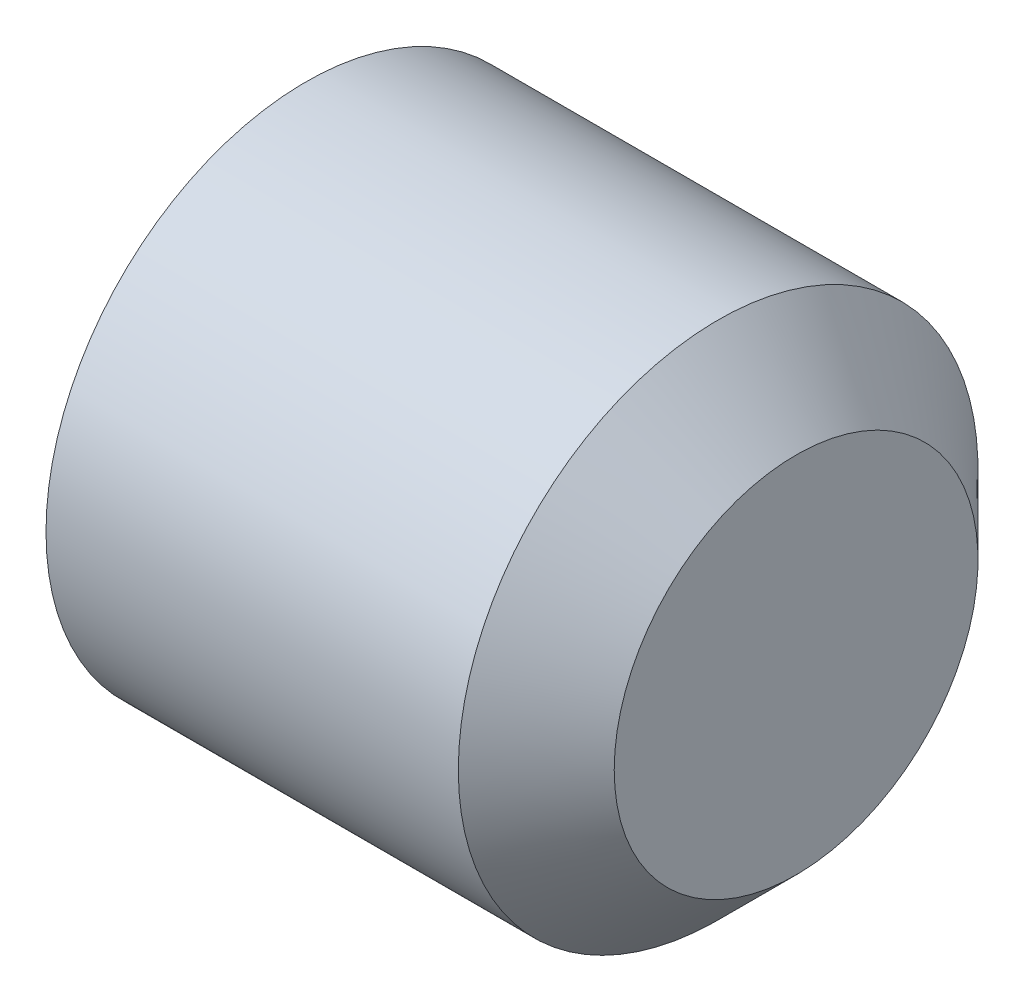
ISO-10303-21;
HEADER;
FILE_DESCRIPTION(('STEP AP214'),'2;1');
FILE_NAME('part.step','',(''),(''),'','','');
FILE_SCHEMA(('AUTOMOTIVE_DESIGN { 1 0 10303 214 1 1 1 1 }'));
ENDSEC;
DATA;
#1=APPLICATION_CONTEXT('core data for automotive mechanical design processes');
#2=APPLICATION_PROTOCOL_DEFINITION('international standard','automotive_design',2000,#1);
#3=PRODUCT_CONTEXT('',#1,'mechanical');
#4=PRODUCT('Part','Part','',(#3));
#5=PRODUCT_RELATED_PRODUCT_CATEGORY('part','',(#4));
#6=PRODUCT_DEFINITION_FORMATION('','',#4);
#7=PRODUCT_DEFINITION_CONTEXT('part definition',#1,'design');
#8=PRODUCT_DEFINITION('design','',#6,#7);
#9=PRODUCT_DEFINITION_SHAPE('','',#8);
#10=(LENGTH_UNIT() NAMED_UNIT(*) SI_UNIT(.MILLI.,.METRE.));
#11=(NAMED_UNIT(*) PLANE_ANGLE_UNIT() SI_UNIT($,.RADIAN.));
#12=(NAMED_UNIT(*) SI_UNIT($,.STERADIAN.) SOLID_ANGLE_UNIT());
#13=UNCERTAINTY_MEASURE_WITH_UNIT(LENGTH_MEASURE(1.E-05),#10,'distance_accuracy_value','');
#14=(GEOMETRIC_REPRESENTATION_CONTEXT(3) GLOBAL_UNCERTAINTY_ASSIGNED_CONTEXT((#13)) GLOBAL_UNIT_ASSIGNED_CONTEXT((#10,
#11,#12)) REPRESENTATION_CONTEXT('',''));
#15=CARTESIAN_POINT('',(0.,0.,0.));
#16=DIRECTION('',(0.,0.,1.));
#17=DIRECTION('',(1.,0.,0.));
#18=AXIS2_PLACEMENT_3D('',#15,#16,#17);
#19=CARTESIAN_POINT('',(0.83333333333333,0.,0.));
#20=DIRECTION('',(-1.,0.,0.));
#21=DIRECTION('',(0.,0.,1.));
#22=AXIS2_PLACEMENT_3D('',#19,#20,#21);
#23=CONICAL_SURFACE('',#22,0.,1.04719755119661);
#24=CARTESIAN_POINT('',(0.,0.,0.));
#25=DIRECTION('',(-1.,0.,0.));
#26=DIRECTION('',(0.,0.,1.));
#27=AXIS2_PLACEMENT_3D('',#24,#25,#26);
#28=CIRCLE('',#27,1.4433756729741);
#29=CARTESIAN_POINT('',(0.,0.,1.4433756729741));
#30=VERTEX_POINT('',#29);
#31=CARTESIAN_POINT('',(0.,1.25000000000003,0.721687836487051));
#32=VERTEX_POINT('',#31);
#33=EDGE_CURVE('E139',#30,#32,#28,.T.);
#34=ORIENTED_EDGE('',*,*,#33,.T.);
#35=CARTESIAN_POINT('',(-6.66746660219313E-05,1.25020000000002,0.721572366433221));
#36=CARTESIAN_POINT('',(0.0182540852363146,1.19526669476825,0.753288124996257));
#37=CARTESIAN_POINT('',(0.0349166937993671,1.13985921349977,0.78527764922173));
#38=CARTESIAN_POINT('',(0.0640026960542333,1.02808463239967,0.849810733708432));
#39=CARTESIAN_POINT('',(0.0764157980239526,0.971715545158301,0.882355441401211));
#40=CARTESIAN_POINT('',(0.0957403123639898,0.859676025913025,0.947041487997347));
#41=CARTESIAN_POINT('',(0.102780310552569,0.804022841540779,0.979172868975923));
#42=CARTESIAN_POINT('',(0.111187567369367,0.692454346091615,1.04358696985658));
#43=CARTESIAN_POINT('',(0.112561784795276,0.636539441062406,1.07586945532691));
#44=CARTESIAN_POINT('',(0.109716662632079,0.532042078818279,1.13620103554816));
#45=CARTESIAN_POINT('',(0.106195901179983,0.483444050118688,1.16425912049995));
#46=CARTESIAN_POINT('',(0.0950328873007429,0.386564637826765,1.22019247526563));
#47=CARTESIAN_POINT('',(0.0873868144273217,0.33828358980784,1.24806755133611));
#48=CARTESIAN_POINT('',(0.0682705452994674,0.241204116145959,1.30411641158758));
#49=CARTESIAN_POINT('',(0.0567192430203415,0.192417989648102,1.33228309485384));
#50=CARTESIAN_POINT('',(0.0305016853061078,0.095573747707899,1.38819614400748));
#51=CARTESIAN_POINT('',(0.0158415978608937,0.0475143896730363,1.41594322730599));
#52=CARTESIAN_POINT('',(-6.66746660267736E-05,-0.000200000000000035,1.44349114302794));
#53=B_SPLINE_CURVE_WITH_KNOTS('',3,(#35,#36,#37,#38,#39,#40,#41,#42,#43,#44,#45,#46,#47,#48,#49,
#50,#51,#52),.UNSPECIFIED.,.F.,.F.,(4,2,2,2,2,2,2,2,4),(0.,0.198150821029562,0.396778196315227,
0.590488617354409,0.783961049317194,0.95248005639866,1.12115539730011,1.29357430343591,
1.46565426976932),.UNSPECIFIED.);
#54=EDGE_CURVE('E11',#32,#30,#53,.T.);
#55=ORIENTED_EDGE('',*,*,#54,.T.);
#56=EDGE_LOOP('',(#34,#55));
#57=FACE_BOUND('',#56,.T.);
#58=ADVANCED_FACE('F40',(#57),#23,.F.);
#59=CARTESIAN_POINT('',(0.,-1.25000000000002,0.721687836487058));
#60=VERTEX_POINT('',#59);
#61=EDGE_CURVE('E138',#60,#30,#28,.T.);
#62=ORIENTED_EDGE('',*,*,#61,.T.);
#63=CARTESIAN_POINT('',(-6.66746660268099E-05,0.000199999999999981,1.44349114302794));
#64=CARTESIAN_POINT('',(0.0182540852363098,-0.0547333052317663,1.4117753844649));
#65=CARTESIAN_POINT('',(0.0349166937993627,-0.110140786500242,1.37978586023943));
#66=CARTESIAN_POINT('',(0.06400269605423,-0.221915367600345,1.31525277575273));
#67=CARTESIAN_POINT('',(0.0764157980239499,-0.278284454841716,1.28270806805995));
#68=CARTESIAN_POINT('',(0.0957403123639879,-0.390323974086993,1.21802202146381));
#69=CARTESIAN_POINT('',(0.102780310552568,-0.445977158459239,1.18589064048523));
#70=CARTESIAN_POINT('',(0.111187567369366,-0.557545653908403,1.12147653960458));
#71=CARTESIAN_POINT('',(0.112561784795275,-0.613460558937613,1.08919405413425));
#72=CARTESIAN_POINT('',(0.10971666263208,-0.717957921181739,1.028862473913));
#73=CARTESIAN_POINT('',(0.106195901179984,-0.76655594988133,1.0008043889612));
#74=CARTESIAN_POINT('',(0.0950328873007448,-0.863435362173253,0.94487103419553));
#75=CARTESIAN_POINT('',(0.087386814427324,-0.911716410192178,0.916995958125047));
#76=CARTESIAN_POINT('',(0.0682705452994706,-1.00879588385406,0.860947097873573));
#77=CARTESIAN_POINT('',(0.0567192430203451,-1.05758201035191,0.832780414607316));
#78=CARTESIAN_POINT('',(0.0305016853061119,-1.15442625229212,0.776867365453675));
#79=CARTESIAN_POINT('',(0.0158415978608981,-1.20248561032698,0.749120282155167));
#80=CARTESIAN_POINT('',(-6.66746660219481E-05,-1.25020000000002,0.721572366433221));
#81=B_SPLINE_CURVE_WITH_KNOTS('',3,(#63,#64,#65,#66,#67,#68,#69,#70,#71,#72,#73,#74,#75,#76,#77,
#78,#79,#80),.UNSPECIFIED.,.F.,.F.,(4,2,2,2,2,2,2,2,4),(0.,0.198150821029564,0.396778196315229,
0.590488617354412,0.783961049317198,0.952480056398663,1.12115539730011,1.29357430343592,
1.46565426976932),.UNSPECIFIED.);
#82=EDGE_CURVE('E54',#30,#60,#81,.T.);
#83=ORIENTED_EDGE('',*,*,#82,.T.);
#84=EDGE_LOOP('',(#62,#83));
#85=FACE_BOUND('',#84,.T.);
#86=ADVANCED_FACE('F214',(#85),#23,.F.);
#87=CARTESIAN_POINT('',(0.,-1.25000000000002,-0.721687836487002));
#88=VERTEX_POINT('',#87);
#89=EDGE_CURVE('E242',#88,#60,#28,.T.);
#90=ORIENTED_EDGE('',*,*,#89,.T.);
#91=CARTESIAN_POINT('',(-0.723125533725218,-1.25000000000002,2.38855450315372));
#92=CARTESIAN_POINT('',(-0.694512714136866,-1.25000000000002,2.33261400232343));
#93=CARTESIAN_POINT('',(-0.66606638488083,-1.25000000000002,2.27658784489106));
#94=CARTESIAN_POINT('',(-0.609585913438912,-1.25000000000002,2.16432677662066));
#95=CARTESIAN_POINT('',(-0.581551780027691,-1.25000000000002,2.10809186137049));
#96=CARTESIAN_POINT('',(-0.498093498263183,-1.25000000000002,1.93882910957217));
#97=CARTESIAN_POINT('',(-0.443411639249018,-1.25000000000002,1.82543388021049));
#98=CARTESIAN_POINT('',(-0.334298848658163,-1.25000000000002,1.59142958961822));
#99=CARTESIAN_POINT('',(-0.280022481335802,-1.25000000000002,1.47074722047899));
#100=CARTESIAN_POINT('',(-0.202661005486305,-1.25000000000002,1.28803679596571));
#101=CARTESIAN_POINT('',(-0.177555163940496,-1.25000000000002,1.22686777081667));
#102=CARTESIAN_POINT('',(-0.129115153823104,-1.25000000000002,1.10383524784599));
#103=CARTESIAN_POINT('',(-0.105780807369272,-1.25000000000002,1.04197182046975));
#104=CARTESIAN_POINT('',(-0.0574567956154591,-1.25000000000002,0.906290686389106));
#105=CARTESIAN_POINT('',(-0.0329155229053761,-1.25000000000002,0.832310829015467));
#106=CARTESIAN_POINT('',(0.0117528005591605,-1.25000000000002,0.683045282747963));
#107=CARTESIAN_POINT('',(0.0318821801489908,-1.25000000000002,0.607760305524386));
#108=CARTESIAN_POINT('',(0.0658999098953772,-1.25000000000002,0.457227311030485));
#109=CARTESIAN_POINT('',(0.0798975032663708,-1.25000000000002,0.382004714348821));
#110=CARTESIAN_POINT('',(0.100694509672485,-1.25000000000002,0.230574793536791));
#111=CARTESIAN_POINT('',(0.107497972399627,-1.25000000000002,0.154368047882492));
#112=CARTESIAN_POINT('',(0.113017067627266,-1.25000000000002,0.000758127504506175));
#113=CARTESIAN_POINT('',(0.111637545538924,-1.25000000000002,-0.0766486420869878));
#114=CARTESIAN_POINT('',(0.100772950050972,-1.25000000000002,-0.230894929107457));
#115=CARTESIAN_POINT('',(0.0912846749924727,-1.25000000000002,-0.307734210380375));
#116=CARTESIAN_POINT('',(0.0651909747562643,-1.25000000000002,-0.461702943031744));
#117=CARTESIAN_POINT('',(0.0484494878936388,-1.25000000000002,-0.538808478119655));
#118=CARTESIAN_POINT('',(0.00949941464194663,-1.25000000000002,-0.691605492713038));
#119=CARTESIAN_POINT('',(-0.0127104303057358,-1.25000000000002,-0.767296642372799));
#120=CARTESIAN_POINT('',(-0.0591758290557663,-1.25000000000002,-0.91131122625957));
#121=CARTESIAN_POINT('',(-0.0831218497054745,-1.25000000000002,-0.979736466805027));
#122=CARTESIAN_POINT('',(-0.133531682963292,-1.25000000000002,-1.11565965802141));
#123=CARTESIAN_POINT('',(-0.159995993229588,-1.25000000000002,-1.18315742237818));
#124=CARTESIAN_POINT('',(-0.214822951192086,-1.25000000000002,-1.31744060643002));
#125=CARTESIAN_POINT('',(-0.243187240234055,-1.25000000000002,-1.38422535089341));
#126=CARTESIAN_POINT('',(-0.301338794191647,-1.25000000000002,-1.51717422229082));
#127=CARTESIAN_POINT('',(-0.331126152263779,-1.25000000000002,-1.58333830825537));
#128=CARTESIAN_POINT('',(-0.418871668434598,-1.25000000000002,-1.77405787301153));
#129=CARTESIAN_POINT('',(-0.478222830298611,-1.25000000000002,-1.89797140255541));
#130=CARTESIAN_POINT('',(-0.568973030237184,-1.25000000000002,-2.08276459736176));
#131=CARTESIAN_POINT('',(-0.59946560514473,-1.25000000000002,-2.14409605852878));
#132=CARTESIAN_POINT('',(-0.660947546416482,-1.25000000000002,-2.26650353643493));
#133=CARTESIAN_POINT('',(-0.691936873120399,-1.25000000000002,-2.32757957308086));
#134=CARTESIAN_POINT('',(-0.723125533725189,-1.25000000000002,-2.38855450315366));
#135=B_SPLINE_CURVE_WITH_KNOTS('',3,(#91,#92,#93,#94,#95,#96,#97,#98,#99,#100,#101,#102,#103,
#104,#105,#106,#107,#108,#109,#110,#111,#112,#113,#114,#115,#116,#117,#118,#119,#120,#121,#122,
#123,#124,#125,#126,#127,#128,#129,#130,#131,#132,#133,#134),.UNSPECIFIED.,.F.,.F.,(4,2,2,2,2,2,
2,2,2,2,2,2,2,2,2,2,2,2,2,2,2,4),(0.,0.188500396101583,0.377004799132287,0.754656745053071,
1.15153907639069,1.3498805083985,1.54820199780876,1.78193522701242,2.0155447804655,
2.24480392033555,2.47393393772945,2.70573354165869,2.93762471161865,3.17406818753763,
3.41056613256657,3.62798696703794,3.84545085726258,4.06310509441107,4.28077359915012,
4.69290371598787,4.8983831803543,5.10384632030758),.UNSPECIFIED.);
#136=EDGE_CURVE('E188',#60,#88,#135,.T.);
#137=ORIENTED_EDGE('',*,*,#136,.T.);
#138=EDGE_LOOP('',(#90,#137));
#139=FACE_BOUND('',#138,.T.);
#140=ADVANCED_FACE('F220',(#139),#23,.F.);
#141=CARTESIAN_POINT('',(0.,0.,-1.44337567297404));
#142=VERTEX_POINT('',#141);
#143=EDGE_CURVE('E240',#142,#88,#28,.T.);
#144=ORIENTED_EDGE('',*,*,#143,.T.);
#145=CARTESIAN_POINT('',(-6.66746660057022E-05,-1.25020000000002,-0.721572366433164));
#146=CARTESIAN_POINT('',(0.0182540852363312,-1.19526669476825,-0.753288124996199));
#147=CARTESIAN_POINT('',(0.0349166937993845,-1.13985921349978,-0.785277649221672));
#148=CARTESIAN_POINT('',(0.0640026960542528,-1.02808463239968,-0.849810733708372));
#149=CARTESIAN_POINT('',(0.0764157980239733,-0.971715545158308,-0.882355441401151));
#150=CARTESIAN_POINT('',(0.0957403123640127,-0.859676025913034,-0.947041487997285));
#151=CARTESIAN_POINT('',(0.102780310552593,-0.80402284154079,-0.979172868975861));
#152=CARTESIAN_POINT('',(0.111187567369394,-0.692454346091628,-1.04358696985652));
#153=CARTESIAN_POINT('',(0.112561784795304,-0.63653944106242,-1.07586945532684));
#154=CARTESIAN_POINT('',(0.10971666263211,-0.532042078818294,-1.13620103554809));
#155=CARTESIAN_POINT('',(0.106195901180015,-0.483444050118702,-1.16425912049989));
#156=CARTESIAN_POINT('',(0.0950328873007757,-0.386564637826775,-1.22019247526556));
#157=CARTESIAN_POINT('',(0.087386814427355,-0.338283589807849,-1.24806755133605));
#158=CARTESIAN_POINT('',(0.0682705452995012,-0.241204116145966,-1.30411641158752));
#159=CARTESIAN_POINT('',(0.0567192430203753,-0.192417989648107,-1.33228309485378));
#160=CARTESIAN_POINT('',(0.0305016853061413,-0.0955737477079013,-1.38819614400743));
#161=CARTESIAN_POINT('',(0.0158415978609268,-0.0475143896730374,-1.41594322730593));
#162=CARTESIAN_POINT('',(-6.66746659940686E-05,0.000200000000000096,-1.44349114302788));
#163=B_SPLINE_CURVE_WITH_KNOTS('',3,(#145,#146,#147,#148,#149,#150,#151,#152,#153,#154,#155,
#156,#157,#158,#159,#160,#161,#162),.UNSPECIFIED.,.F.,.F.,(4,2,2,2,2,2,2,2,4),(0.,
0.198150821029559,0.396778196315219,0.590488617354397,0.783961049317178,0.952480056398648,
1.1211553973001,1.29357430343591,1.46565426976932),.UNSPECIFIED.);
#164=EDGE_CURVE('E182',#88,#142,#163,.T.);
#165=ORIENTED_EDGE('',*,*,#164,.T.);
#166=EDGE_LOOP('',(#144,#165));
#167=FACE_BOUND('',#166,.T.);
#168=ADVANCED_FACE('F231',(#167),#23,.F.);
#169=CARTESIAN_POINT('',(0.,1.25000000000002,-0.721687836487002));
#170=VERTEX_POINT('',#169);
#171=EDGE_CURVE('E238',#170,#142,#28,.T.);
#172=ORIENTED_EDGE('',*,*,#171,.T.);
#173=CARTESIAN_POINT('',(-6.66746659941212E-05,-0.000199999999999926,-1.44349114302788));
#174=CARTESIAN_POINT('',(0.0182540852363418,0.0547333052317643,-1.41177538446485));
#175=CARTESIAN_POINT('',(0.034916693799394,0.110140786500238,-1.37978586023937));
#176=CARTESIAN_POINT('',(0.0640026960542601,0.221915367600336,-1.31525277575267));
#177=CARTESIAN_POINT('',(0.0764157980239795,0.278284454841706,-1.2827080680599));
#178=CARTESIAN_POINT('',(0.0957403123640169,0.390323974086978,-1.21802202146376));
#179=CARTESIAN_POINT('',(0.102780310552596,0.445977158459222,-1.18589064048519));
#180=CARTESIAN_POINT('',(0.111187567369395,0.557545653908382,-1.12147653960453));
#181=CARTESIAN_POINT('',(0.112561784795304,0.613460558937589,-1.08919405413421));
#182=CARTESIAN_POINT('',(0.109716662632108,0.717957921181716,-1.02886247391296));
#183=CARTESIAN_POINT('',(0.106195901180012,0.766555949881308,-1.00080438896116));
#184=CARTESIAN_POINT('',(0.0950328873007713,0.863435362173236,-0.944871034195484));
#185=CARTESIAN_POINT('',(0.0873868144273497,0.911716410192163,-0.916995958124999));
#186=CARTESIAN_POINT('',(0.0682705452994941,1.00879588385405,-0.860947097873523));
#187=CARTESIAN_POINT('',(0.0567192430203673,1.05758201035191,-0.832780414607265));
#188=CARTESIAN_POINT('',(0.0305016853061314,1.15442625229211,-0.776867365453621));
#189=CARTESIAN_POINT('',(0.015841597860916,1.20248561032698,-0.749120282155111));
#190=CARTESIAN_POINT('',(-6.66746660057401E-05,1.25020000000002,-0.721572366433164));
#191=B_SPLINE_CURVE_WITH_KNOTS('',3,(#173,#174,#175,#176,#177,#178,#179,#180,#181,#182,#183,
#184,#185,#186,#187,#188,#189,#190),.UNSPECIFIED.,.F.,.F.,(4,2,2,2,2,2,2,2,4),(0.,
0.198150821029556,0.396778196315213,0.590488617354389,0.783961049317167,0.952480056398639,
1.1211553973001,1.29357430343591,1.46565426976932),.UNSPECIFIED.);
#192=EDGE_CURVE('E121',#142,#170,#191,.T.);
#193=ORIENTED_EDGE('',*,*,#192,.T.);
#194=EDGE_LOOP('',(#172,#193));
#195=FACE_BOUND('',#194,.T.);
#196=ADVANCED_FACE('F223',(#195),#23,.F.);
#197=EDGE_CURVE('E143',#32,#170,#28,.T.);
#198=ORIENTED_EDGE('',*,*,#197,.T.);
#199=CARTESIAN_POINT('',(-0.72312553372519,1.25000000000002,-2.38855450315366));
#200=CARTESIAN_POINT('',(-0.694512714136838,1.25000000000002,-2.33261400232338));
#201=CARTESIAN_POINT('',(-0.666066384880803,1.25000000000002,-2.27658784489101));
#202=CARTESIAN_POINT('',(-0.609585913438887,1.25000000000002,-2.16432677662061));
#203=CARTESIAN_POINT('',(-0.581551780027666,1.25000000000002,-2.10809186137044));
#204=CARTESIAN_POINT('',(-0.49809349826316,1.25000000000002,-1.93882910957213));
#205=CARTESIAN_POINT('',(-0.443411639248997,1.25000000000002,-1.82543388021045));
#206=CARTESIAN_POINT('',(-0.334298848658144,1.25000000000002,-1.59142958961817));
#207=CARTESIAN_POINT('',(-0.280022481335785,1.25000000000002,-1.47074722047895));
#208=CARTESIAN_POINT('',(-0.20266100548629,1.25000000000002,-1.28803679596567));
#209=CARTESIAN_POINT('',(-0.177555163940482,1.25000000000002,-1.22686777081664));
#210=CARTESIAN_POINT('',(-0.129115153823092,1.25000000000002,-1.10383524784596));
#211=CARTESIAN_POINT('',(-0.105780807369261,1.25000000000002,-1.04197182046972));
#212=CARTESIAN_POINT('',(-0.0574567956154493,1.25000000000002,-0.906290686389077));
#213=CARTESIAN_POINT('',(-0.0329155229053671,1.25000000000002,-0.832310829015439));
#214=CARTESIAN_POINT('',(0.0117528005591679,1.25000000000002,-0.683045282747935));
#215=CARTESIAN_POINT('',(0.0318821801489975,1.25000000000002,-0.607760305524359));
#216=CARTESIAN_POINT('',(0.0658999098953822,1.25000000000002,-0.45722731103046));
#217=CARTESIAN_POINT('',(0.0798975032663748,1.25000000000002,-0.382004714348796));
#218=CARTESIAN_POINT('',(0.100694509672488,1.25000000000002,-0.230574793536767));
#219=CARTESIAN_POINT('',(0.107497972399629,1.25000000000002,-0.154368047882468));
#220=CARTESIAN_POINT('',(0.113017067627266,1.25000000000002,-0.000758127504484545));
#221=CARTESIAN_POINT('',(0.111637545538924,1.25000000000002,0.0766486420870085));
#222=CARTESIAN_POINT('',(0.10077295005097,1.25000000000002,0.230894929107476));
#223=CARTESIAN_POINT('',(0.0912846749924701,1.25000000000002,0.307734210380393));
#224=CARTESIAN_POINT('',(0.0651909747562611,1.25000000000002,0.46170294303176));
#225=CARTESIAN_POINT('',(0.0484494878936356,1.25000000000002,0.53880847811967));
#226=CARTESIAN_POINT('',(0.0094994146419431,1.25000000000002,0.691605492713051));
#227=CARTESIAN_POINT('',(-0.0127104303057395,1.25000000000002,0.767296642372811));
#228=CARTESIAN_POINT('',(-0.0591758290557709,1.25000000000002,0.911311226259583));
#229=CARTESIAN_POINT('',(-0.08312184970548,1.25000000000002,0.979736466805042));
#230=CARTESIAN_POINT('',(-0.1335316829633,1.25000000000002,1.11565965802143));
#231=CARTESIAN_POINT('',(-0.159995993229597,1.25000000000002,1.1831574223782));
#232=CARTESIAN_POINT('',(-0.214822951192096,1.25000000000002,1.31744060643004));
#233=CARTESIAN_POINT('',(-0.243187240234067,1.25000000000002,1.38422535089344));
#234=CARTESIAN_POINT('',(-0.301338794191661,1.25000000000002,1.51717422229085));
#235=CARTESIAN_POINT('',(-0.331126152263794,1.25000000000002,1.5833383082554));
#236=CARTESIAN_POINT('',(-0.418871668434616,1.25000000000002,1.77405787301157));
#237=CARTESIAN_POINT('',(-0.478222830298631,1.25000000000002,1.89797140255546));
#238=CARTESIAN_POINT('',(-0.568973030237207,1.25000000000002,2.0827645973618));
#239=CARTESIAN_POINT('',(-0.599465605144755,1.25000000000002,2.14409605852883));
#240=CARTESIAN_POINT('',(-0.660947546416509,1.25000000000002,2.26650353643498));
#241=CARTESIAN_POINT('',(-0.691936873120427,1.25000000000002,2.32757957308092));
#242=CARTESIAN_POINT('',(-0.723125533725218,1.25000000000002,2.38855450315372));
#243=B_SPLINE_CURVE_WITH_KNOTS('',3,(#199,#200,#201,#202,#203,#204,#205,#206,#207,#208,#209,
#210,#211,#212,#213,#214,#215,#216,#217,#218,#219,#220,#221,#222,#223,#224,#225,#226,#227,#228,
#229,#230,#231,#232,#233,#234,#235,#236,#237,#238,#239,#240,#241,#242),.UNSPECIFIED.,.F.,.F.,(4,
2,2,2,2,2,2,2,2,2,2,2,2,2,2,2,2,2,2,2,2,4),(0.,0.188500396101579,0.377004799132279,
0.754656745053056,1.15153907639067,1.34988050839847,1.54820199780873,1.78193522701238,
2.01554478046546,2.24480392033551,2.47393393772941,2.70573354165865,2.93762471161861,
3.17406818753758,3.41056613256652,3.62798696703789,3.84545085726254,4.06310509441104,
4.28077359915009,4.69290371598786,4.89838318035429,5.10384632030758),.UNSPECIFIED.);
#244=EDGE_CURVE('E87',#170,#32,#243,.T.);
#245=ORIENTED_EDGE('',*,*,#244,.T.);
#246=EDGE_LOOP('',(#198,#245));
#247=FACE_BOUND('',#246,.T.);
#248=ADVANCED_FACE('F216',(#247),#23,.F.);
#249=CARTESIAN_POINT('',(5.,0.,0.));
#250=DIRECTION('',(1.,0.,0.));
#251=DIRECTION('',(0.,0.,-1.));
#252=AXIS2_PLACEMENT_3D('',#249,#250,#251);
#253=PLANE('',#252);
#254=CARTESIAN_POINT('',(5.,0.,0.));
#255=DIRECTION('',(-1.,0.,0.));
#256=DIRECTION('',(0.,0.,1.));
#257=AXIS2_PLACEMENT_3D('',#254,#255,#256);
#258=CIRCLE('',#257,1.75);
#259=CARTESIAN_POINT('',(5.,0.,1.75));
#260=VERTEX_POINT('',#259);
#261=EDGE_CURVE('E152',#260,#260,#258,.T.);
#262=ORIENTED_EDGE('',*,*,#261,.F.);
#263=EDGE_LOOP('',(#262));
#264=FACE_BOUND('',#263,.T.);
#265=ADVANCED_FACE('F42',(#264),#253,.T.);
#266=CARTESIAN_POINT('',(4.25,0.,0.));
#267=DIRECTION('',(-1.,0.,0.));
#268=DIRECTION('',(0.,0.,1.));
#269=AXIS2_PLACEMENT_3D('',#266,#267,#268);
#270=CONICAL_SURFACE('',#269,2.5,0.785398163397449);
#271=ORIENTED_EDGE('',*,*,#261,.T.);
#272=EDGE_LOOP('',(#271));
#273=FACE_BOUND('',#272,.T.);
#274=CARTESIAN_POINT('',(4.25,0.,0.));
#275=DIRECTION('',(-1.,0.,0.));
#276=DIRECTION('',(0.,0.,1.));
#277=AXIS2_PLACEMENT_3D('',#274,#275,#276);
#278=CIRCLE('',#277,2.5);
#279=CARTESIAN_POINT('',(4.25,0.,2.5));
#280=VERTEX_POINT('',#279);
#281=EDGE_CURVE('E149',#280,#280,#278,.T.);
#282=ORIENTED_EDGE('',*,*,#281,.F.);
#283=EDGE_LOOP('',(#282));
#284=FACE_BOUND('',#283,.T.);
#285=ADVANCED_FACE('F229',(#273,#284),#270,.T.);
#286=CARTESIAN_POINT('',(0.83333333333333,0.,0.));
#287=DIRECTION('',(-1.,0.,0.));
#288=DIRECTION('',(0.,0.,1.));
#289=AXIS2_PLACEMENT_3D('',#286,#287,#288);
#290=CYLINDRICAL_SURFACE('',#289,2.5);
#291=ORIENTED_EDGE('',*,*,#281,.T.);
#292=EDGE_LOOP('',(#291));
#293=FACE_BOUND('',#292,.T.);
#294=CARTESIAN_POINT('',(0.28319030703751,0.,0.));
#295=DIRECTION('',(-1.,0.,0.));
#296=DIRECTION('',(0.,0.,1.));
#297=AXIS2_PLACEMENT_3D('',#294,#295,#296);
#298=CIRCLE('',#297,2.5);
#299=CARTESIAN_POINT('',(0.28319030703751,0.,2.5));
#300=VERTEX_POINT('',#299);
#301=EDGE_CURVE('E146',#300,#300,#298,.T.);
#302=ORIENTED_EDGE('',*,*,#301,.F.);
#303=EDGE_LOOP('',(#302));
#304=FACE_BOUND('',#303,.T.);
#305=ADVANCED_FACE('F280',(#293,#304),#290,.T.);
#306=CARTESIAN_POINT('',(0.,0.,0.));
#307=DIRECTION('',(1.,0.,0.));
#308=DIRECTION('',(0.,0.,-1.));
#309=AXIS2_PLACEMENT_3D('',#306,#307,#308);
#310=CONICAL_SURFACE('',#309,2.0095,1.0471975511966);
#311=ORIENTED_EDGE('',*,*,#301,.T.);
#312=EDGE_LOOP('',(#311));
#313=FACE_BOUND('',#312,.T.);
#314=CARTESIAN_POINT('',(0.,0.,0.));
#315=DIRECTION('',(-1.,0.,0.));
#316=DIRECTION('',(0.,0.,1.));
#317=AXIS2_PLACEMENT_3D('',#314,#315,#316);
#318=CIRCLE('',#317,2.0095);
#319=CARTESIAN_POINT('',(0.,0.,2.0095));
#320=VERTEX_POINT('',#319);
#321=EDGE_CURVE('E142',#320,#320,#318,.T.);
#322=ORIENTED_EDGE('',*,*,#321,.F.);
#323=EDGE_LOOP('',(#322));
#324=FACE_BOUND('',#323,.T.);
#325=ADVANCED_FACE('F211',(#313,#324),#310,.T.);
#326=CARTESIAN_POINT('',(0.,-2.0095,0.));
#327=DIRECTION('',(-1.,0.,0.));
#328=DIRECTION('',(0.,0.,1.));
#329=AXIS2_PLACEMENT_3D('',#326,#327,#328);
#330=PLANE('',#329);
#331=ORIENTED_EDGE('',*,*,#321,.T.);
#332=EDGE_LOOP('',(#331));
#333=FACE_BOUND('',#332,.T.);
#334=ORIENTED_EDGE('',*,*,#33,.F.);
#335=ORIENTED_EDGE('',*,*,#61,.F.);
#336=ORIENTED_EDGE('',*,*,#89,.F.);
#337=ORIENTED_EDGE('',*,*,#143,.F.);
#338=ORIENTED_EDGE('',*,*,#171,.F.);
#339=ORIENTED_EDGE('',*,*,#197,.F.);
#340=EDGE_LOOP('',(#334,#335,#336,#337,#338,#339));
#341=FACE_BOUND('',#340,.T.);
#342=ADVANCED_FACE('F206',(#333,#341),#330,.T.);
#343=CARTESIAN_POINT('',(2.,1.25000000000002,0.721687836487058));
#344=DIRECTION('',(0.,-0.5,-0.866025403784439));
#345=DIRECTION('',(0.,0.866025403784439,-0.5));
#346=AXIS2_PLACEMENT_3D('',#343,#344,#345);
#347=PLANE('',#346);
#348=DIRECTION('',(-1.,0.,0.));
#349=VECTOR('',#348,1.);
#350=CARTESIAN_POINT('',(2.,1.25000000000002,0.721687836487058));
#351=LINE('',#350,#349);
#352=CARTESIAN_POINT('',(2.,1.25000000000002,0.721687836487058));
#353=VERTEX_POINT('',#352);
#354=EDGE_CURVE('E61',#353,#32,#351,.T.);
#355=ORIENTED_EDGE('',*,*,#354,.F.);
#356=DIRECTION('',(0.,-0.866025403784439,0.5));
#357=VECTOR('',#356,1.);
#358=CARTESIAN_POINT('',(2.,1.25000000000002,0.721687836487058));
#359=LINE('',#358,#357);
#360=CARTESIAN_POINT('',(2.,0.,1.4433756729741));
#361=VERTEX_POINT('',#360);
#362=EDGE_CURVE('E251',#353,#361,#359,.T.);
#363=ORIENTED_EDGE('',*,*,#362,.T.);
#364=DIRECTION('',(-1.,0.,0.));
#365=VECTOR('',#364,1.);
#366=CARTESIAN_POINT('',(2.,0.,1.4433756729741));
#367=LINE('',#366,#365);
#368=EDGE_CURVE('E135',#361,#30,#367,.T.);
#369=ORIENTED_EDGE('',*,*,#368,.T.);
#370=ORIENTED_EDGE('',*,*,#54,.F.);
#371=EDGE_LOOP('',(#355,#363,#369,#370));
#372=FACE_BOUND('',#371,.T.);
#373=ADVANCED_FACE('F202',(#372),#347,.T.);
#374=CARTESIAN_POINT('',(2.,0.,1.4433756729741));
#375=DIRECTION('',(0.,0.5,-0.866025403784439));
#376=DIRECTION('',(0.,0.866025403784439,0.5));
#377=AXIS2_PLACEMENT_3D('',#374,#375,#376);
#378=PLANE('',#377);
#379=ORIENTED_EDGE('',*,*,#368,.F.);
#380=DIRECTION('',(0.,-0.866025403784439,-0.5));
#381=VECTOR('',#380,1.);
#382=CARTESIAN_POINT('',(2.,0.,1.4433756729741));
#383=LINE('',#382,#381);
#384=CARTESIAN_POINT('',(2.,-1.25000000000002,0.721687836487058));
#385=VERTEX_POINT('',#384);
#386=EDGE_CURVE('E96',#361,#385,#383,.T.);
#387=ORIENTED_EDGE('',*,*,#386,.T.);
#388=DIRECTION('',(-1.,0.,0.));
#389=VECTOR('',#388,1.);
#390=CARTESIAN_POINT('',(2.,-1.25000000000002,0.721687836487058));
#391=LINE('',#390,#389);
#392=EDGE_CURVE('E132',#385,#60,#391,.T.);
#393=ORIENTED_EDGE('',*,*,#392,.T.);
#394=ORIENTED_EDGE('',*,*,#82,.F.);
#395=EDGE_LOOP('',(#379,#387,#393,#394));
#396=FACE_BOUND('',#395,.T.);
#397=ADVANCED_FACE('F199',(#396),#378,.T.);
#398=CARTESIAN_POINT('',(2.,-1.25000000000002,0.721687836487058));
#399=DIRECTION('',(0.,1.,0.));
#400=DIRECTION('',(0.,0.,1.));
#401=AXIS2_PLACEMENT_3D('',#398,#399,#400);
#402=PLANE('',#401);
#403=ORIENTED_EDGE('',*,*,#392,.F.);
#404=DIRECTION('',(0.,0.,-1.));
#405=VECTOR('',#404,1.);
#406=CARTESIAN_POINT('',(2.,-1.25000000000002,0.721687836487058));
#407=LINE('',#406,#405);
#408=CARTESIAN_POINT('',(2.,-1.25000000000002,-0.721687836487002));
#409=VERTEX_POINT('',#408);
#410=EDGE_CURVE('E116',#385,#409,#407,.T.);
#411=ORIENTED_EDGE('',*,*,#410,.T.);
#412=DIRECTION('',(-1.,0.,0.));
#413=VECTOR('',#412,1.);
#414=CARTESIAN_POINT('',(2.,-1.25000000000002,-0.721687836487002));
#415=LINE('',#414,#413);
#416=EDGE_CURVE('E113',#409,#88,#415,.T.);
#417=ORIENTED_EDGE('',*,*,#416,.T.);
#418=ORIENTED_EDGE('',*,*,#136,.F.);
#419=EDGE_LOOP('',(#403,#411,#417,#418));
#420=FACE_BOUND('',#419,.T.);
#421=ADVANCED_FACE('F179',(#420),#402,.T.);
#422=CARTESIAN_POINT('',(2.,-1.25000000000002,-0.721687836487002));
#423=DIRECTION('',(0.,0.5,0.866025403784439));
#424=DIRECTION('',(0.,-0.866025403784439,0.5));
#425=AXIS2_PLACEMENT_3D('',#422,#423,#424);
#426=PLANE('',#425);
#427=ORIENTED_EDGE('',*,*,#416,.F.);
#428=DIRECTION('',(0.,0.866025403784439,-0.5));
#429=VECTOR('',#428,1.);
#430=CARTESIAN_POINT('',(2.,-1.25000000000002,-0.721687836487002));
#431=LINE('',#430,#429);
#432=CARTESIAN_POINT('',(2.,0.,-1.44337567297404));
#433=VERTEX_POINT('',#432);
#434=EDGE_CURVE('E107',#409,#433,#431,.T.);
#435=ORIENTED_EDGE('',*,*,#434,.T.);
#436=DIRECTION('',(-1.,0.,0.));
#437=VECTOR('',#436,1.);
#438=CARTESIAN_POINT('',(2.,0.,-1.44337567297404));
#439=LINE('',#438,#437);
#440=EDGE_CURVE('E110',#433,#142,#439,.T.);
#441=ORIENTED_EDGE('',*,*,#440,.T.);
#442=ORIENTED_EDGE('',*,*,#164,.F.);
#443=EDGE_LOOP('',(#427,#435,#441,#442));
#444=FACE_BOUND('',#443,.T.);
#445=ADVANCED_FACE('F109',(#444),#426,.T.);
#446=CARTESIAN_POINT('',(2.,0.,-1.44337567297404));
#447=DIRECTION('',(0.,-0.5,0.866025403784439));
#448=DIRECTION('',(0.,-0.866025403784439,-0.5));
#449=AXIS2_PLACEMENT_3D('',#446,#447,#448);
#450=PLANE('',#449);
#451=ORIENTED_EDGE('',*,*,#440,.F.);
#452=DIRECTION('',(0.,0.866025403784439,0.5));
#453=VECTOR('',#452,1.);
#454=CARTESIAN_POINT('',(2.,0.,-1.44337567297404));
#455=LINE('',#454,#453);
#456=CARTESIAN_POINT('',(2.,1.25000000000002,-0.721687836487002));
#457=VERTEX_POINT('',#456);
#458=EDGE_CURVE('E115',#433,#457,#455,.T.);
#459=ORIENTED_EDGE('',*,*,#458,.T.);
#460=DIRECTION('',(-1.,0.,0.));
#461=VECTOR('',#460,1.);
#462=CARTESIAN_POINT('',(2.,1.25000000000002,-0.721687836487002));
#463=LINE('',#462,#461);
#464=EDGE_CURVE('E122',#457,#170,#463,.T.);
#465=ORIENTED_EDGE('',*,*,#464,.T.);
#466=ORIENTED_EDGE('',*,*,#192,.F.);
#467=EDGE_LOOP('',(#451,#459,#465,#466));
#468=FACE_BOUND('',#467,.T.);
#469=ADVANCED_FACE('F119',(#468),#450,.T.);
#470=CARTESIAN_POINT('',(2.,1.25000000000002,-0.721687836487002));
#471=DIRECTION('',(0.,-1.,0.));
#472=DIRECTION('',(0.,0.,-1.));
#473=AXIS2_PLACEMENT_3D('',#470,#471,#472);
#474=PLANE('',#473);
#475=ORIENTED_EDGE('',*,*,#464,.F.);
#476=DIRECTION('',(0.,0.,1.));
#477=VECTOR('',#476,1.);
#478=CARTESIAN_POINT('',(2.,1.25000000000002,-0.721687836487002));
#479=LINE('',#478,#477);
#480=EDGE_CURVE('E67',#457,#353,#479,.T.);
#481=ORIENTED_EDGE('',*,*,#480,.T.);
#482=ORIENTED_EDGE('',*,*,#354,.T.);
#483=ORIENTED_EDGE('',*,*,#244,.F.);
#484=EDGE_LOOP('',(#475,#481,#482,#483));
#485=FACE_BOUND('',#484,.T.);
#486=ADVANCED_FACE('F169',(#485),#474,.T.);
#487=CARTESIAN_POINT('',(2.,0.,0.));
#488=DIRECTION('',(1.,0.,0.));
#489=DIRECTION('',(0.,0.,-1.));
#490=AXIS2_PLACEMENT_3D('',#487,#488,#489);
#491=PLANE('',#490);
#492=ORIENTED_EDGE('',*,*,#362,.F.);
#493=ORIENTED_EDGE('',*,*,#480,.F.);
#494=ORIENTED_EDGE('',*,*,#458,.F.);
#495=ORIENTED_EDGE('',*,*,#434,.F.);
#496=ORIENTED_EDGE('',*,*,#410,.F.);
#497=ORIENTED_EDGE('',*,*,#386,.F.);
#498=EDGE_LOOP('',(#492,#493,#494,#495,#496,#497));
#499=FACE_BOUND('',#498,.T.);
#500=ADVANCED_FACE('F124',(#499),#491,.F.);
#501=CLOSED_SHELL('',(#58,#86,#140,#168,#196,#248,#265,#285,#305,#325,#342,#373,#397,#421,#445,
#469,#486,#500));
#502=MANIFOLD_SOLID_BREP('B2',#501);
#503=ADVANCED_BREP_SHAPE_REPRESENTATION('',(#18,#502),#14);
#504=SHAPE_DEFINITION_REPRESENTATION(#9,#503);
ENDSEC;
END-ISO-10303-21;
